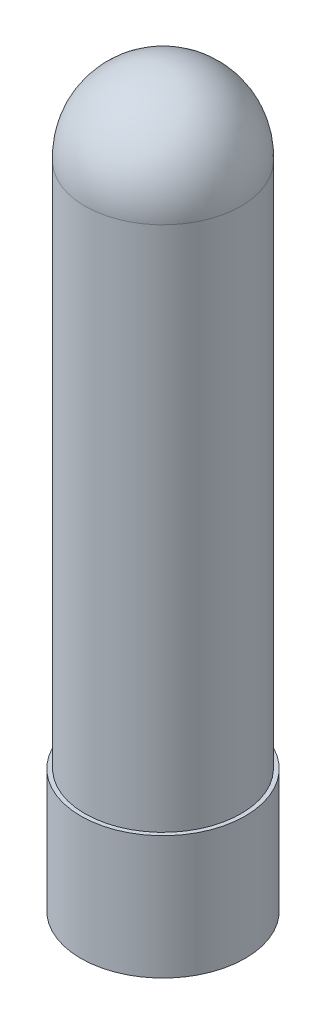
ISO-10303-21;
HEADER;
FILE_DESCRIPTION(('STEP AP214'),'2;1');
FILE_NAME('part.step','',(''),(''),'','','');
FILE_SCHEMA(('AUTOMOTIVE_DESIGN { 1 0 10303 214 1 1 1 1 }'));
ENDSEC;
DATA;
#1=APPLICATION_CONTEXT('core data for automotive mechanical design processes');
#2=APPLICATION_PROTOCOL_DEFINITION('international standard','automotive_design',2000,#1);
#3=PRODUCT_CONTEXT('',#1,'mechanical');
#4=PRODUCT('Part','Part','',(#3));
#5=PRODUCT_RELATED_PRODUCT_CATEGORY('part','',(#4));
#6=PRODUCT_DEFINITION_FORMATION('','',#4);
#7=PRODUCT_DEFINITION_CONTEXT('part definition',#1,'design');
#8=PRODUCT_DEFINITION('design','',#6,#7);
#9=PRODUCT_DEFINITION_SHAPE('','',#8);
#10=(LENGTH_UNIT() NAMED_UNIT(*) SI_UNIT(.MILLI.,.METRE.));
#11=(NAMED_UNIT(*) PLANE_ANGLE_UNIT() SI_UNIT($,.RADIAN.));
#12=(NAMED_UNIT(*) SI_UNIT($,.STERADIAN.) SOLID_ANGLE_UNIT());
#13=UNCERTAINTY_MEASURE_WITH_UNIT(LENGTH_MEASURE(1.E-05),#10,'distance_accuracy_value','');
#14=(GEOMETRIC_REPRESENTATION_CONTEXT(3) GLOBAL_UNCERTAINTY_ASSIGNED_CONTEXT((#13)) GLOBAL_UNIT_ASSIGNED_CONTEXT((#10,
#11,#12)) REPRESENTATION_CONTEXT('',''));
#15=CARTESIAN_POINT('',(0.,0.,0.));
#16=DIRECTION('',(0.,0.,1.));
#17=DIRECTION('',(1.,0.,0.));
#18=AXIS2_PLACEMENT_3D('',#15,#16,#17);
#19=CARTESIAN_POINT('',(0.,15.,0.));
#20=DIRECTION('',(0.,1.,0.));
#21=DIRECTION('',(0.,0.,1.));
#22=AXIS2_PLACEMENT_3D('',#19,#20,#21);
#23=PLANE('',#22);
#24=CARTESIAN_POINT('',(0.,15.,0.));
#25=DIRECTION('',(0.,1.,0.));
#26=DIRECTION('',(0.,0.,1.));
#27=AXIS2_PLACEMENT_3D('',#24,#25,#26);
#28=CIRCLE('',#27,10.);
#29=CARTESIAN_POINT('',(0.,15.,10.));
#30=VERTEX_POINT('',#29);
#31=EDGE_CURVE('E10',#30,#30,#28,.T.);
#32=ORIENTED_EDGE('',*,*,#31,.T.);
#33=EDGE_LOOP('',(#32));
#34=FACE_BOUND('',#33,.T.);
#35=CARTESIAN_POINT('',(0.,15.,0.));
#36=DIRECTION('',(0.,1.,0.));
#37=DIRECTION('',(0.,0.,1.));
#38=AXIS2_PLACEMENT_3D('',#35,#36,#37);
#39=CIRCLE('',#38,9.5);
#40=CARTESIAN_POINT('',(0.,15.,9.5));
#41=VERTEX_POINT('',#40);
#42=EDGE_CURVE('E45',#41,#41,#39,.T.);
#43=ORIENTED_EDGE('',*,*,#42,.F.);
#44=EDGE_LOOP('',(#43));
#45=FACE_BOUND('',#44,.T.);
#46=ADVANCED_FACE('F31',(#34,#45),#23,.T.);
#47=CARTESIAN_POINT('',(0.,15.,0.));
#48=DIRECTION('',(0.,-1.,0.));
#49=DIRECTION('',(0.,0.,-1.));
#50=AXIS2_PLACEMENT_3D('',#47,#48,#49);
#51=CYLINDRICAL_SURFACE('',#50,10.);
#52=ORIENTED_EDGE('',*,*,#31,.F.);
#53=EDGE_LOOP('',(#52));
#54=FACE_BOUND('',#53,.T.);
#55=CARTESIAN_POINT('',(0.,0.,0.));
#56=DIRECTION('',(0.,1.,0.));
#57=DIRECTION('',(0.,0.,1.));
#58=AXIS2_PLACEMENT_3D('',#55,#56,#57);
#59=CIRCLE('',#58,10.);
#60=CARTESIAN_POINT('',(0.,0.,10.));
#61=VERTEX_POINT('',#60);
#62=EDGE_CURVE('E39',#61,#61,#59,.T.);
#63=ORIENTED_EDGE('',*,*,#62,.T.);
#64=EDGE_LOOP('',(#63));
#65=FACE_BOUND('',#64,.T.);
#66=ADVANCED_FACE('F61',(#54,#65),#51,.T.);
#67=CARTESIAN_POINT('',(0.,0.,0.));
#68=DIRECTION('',(0.,1.,0.));
#69=DIRECTION('',(0.,0.,1.));
#70=AXIS2_PLACEMENT_3D('',#67,#68,#69);
#71=PLANE('',#70);
#72=ORIENTED_EDGE('',*,*,#62,.F.);
#73=EDGE_LOOP('',(#72));
#74=FACE_BOUND('',#73,.T.);
#75=ADVANCED_FACE('F55',(#74),#71,.F.);
#76=CARTESIAN_POINT('',(0.,79.,0.));
#77=DIRECTION('',(0.,-1.,0.));
#78=DIRECTION('',(0.,0.,-1.));
#79=AXIS2_PLACEMENT_3D('',#76,#77,#78);
#80=CYLINDRICAL_SURFACE('',#79,9.5);
#81=CARTESIAN_POINT('',(0.,79.,0.));
#82=DIRECTION('',(0.,1.,0.));
#83=DIRECTION('',(0.,0.,1.));
#84=AXIS2_PLACEMENT_3D('',#81,#82,#83);
#85=CIRCLE('',#84,9.5);
#86=CARTESIAN_POINT('',(0.,79.,9.5));
#87=VERTEX_POINT('',#86);
#88=EDGE_CURVE('E35',#87,#87,#85,.T.);
#89=ORIENTED_EDGE('',*,*,#88,.F.);
#90=EDGE_LOOP('',(#89));
#91=FACE_BOUND('',#90,.T.);
#92=ORIENTED_EDGE('',*,*,#42,.T.);
#93=EDGE_LOOP('',(#92));
#94=FACE_BOUND('',#93,.T.);
#95=ADVANCED_FACE('F53',(#91,#94),#80,.T.);
#96=CARTESIAN_POINT('',(0.,79.4875,0.));
#97=DIRECTION('',(0.,0.,1.));
#98=DIRECTION('',(1.,0.,0.));
#99=AXIS2_PLACEMENT_3D('',#96,#97,#98);
#100=SPHERICAL_SURFACE('',#99,9.5125);
#101=CARTESIAN_POINT('',(0.,79.4875,0.));
#102=DIRECTION('',(0.,1.,0.));
#103=DIRECTION('',(0.,0.,1.));
#104=AXIS2_PLACEMENT_3D('',#101,#102,#103);
#105=SPHERICAL_SURFACE('',#104,9.5125);
#106=ORIENTED_EDGE('',*,*,#88,.T.);
#107=EDGE_LOOP('',(#106));
#108=FACE_BOUND('',#107,.T.);
#109=ADVANCED_FACE('F33',(#108),#105,.T.);
#110=CLOSED_SHELL('',(#46,#66,#75,#95,#109));
#111=MANIFOLD_SOLID_BREP('B2',#110);
#112=ADVANCED_BREP_SHAPE_REPRESENTATION('',(#18,#111),#14);
#113=SHAPE_DEFINITION_REPRESENTATION(#9,#112);
ENDSEC;
END-ISO-10303-21;
